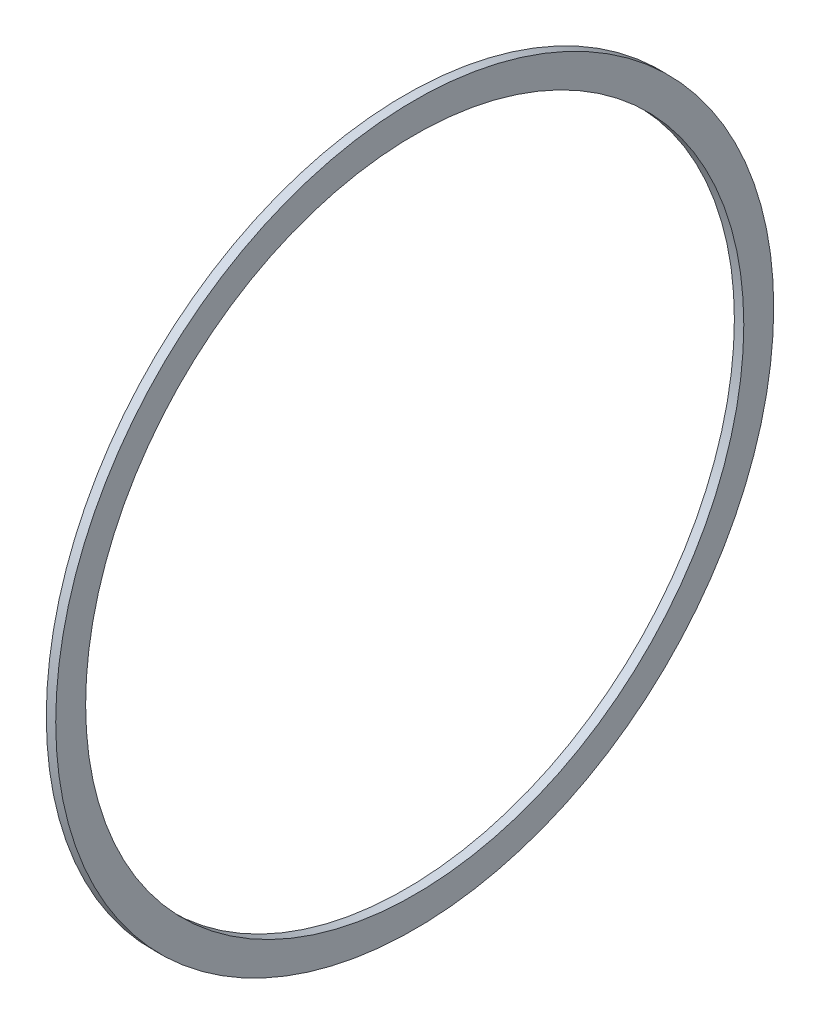
ISO-10303-21;
HEADER;
FILE_DESCRIPTION(('STEP AP214'),'2;1');
FILE_NAME('part.step','',(''),(''),'','','');
FILE_SCHEMA(('AUTOMOTIVE_DESIGN { 1 0 10303 214 1 1 1 1 }'));
ENDSEC;
DATA;
#1=APPLICATION_CONTEXT('core data for automotive mechanical design processes');
#2=APPLICATION_PROTOCOL_DEFINITION('international standard','automotive_design',2000,#1);
#3=PRODUCT_CONTEXT('',#1,'mechanical');
#4=PRODUCT('Part','Part','',(#3));
#5=PRODUCT_RELATED_PRODUCT_CATEGORY('part','',(#4));
#6=PRODUCT_DEFINITION_FORMATION('','',#4);
#7=PRODUCT_DEFINITION_CONTEXT('part definition',#1,'design');
#8=PRODUCT_DEFINITION('design','',#6,#7);
#9=PRODUCT_DEFINITION_SHAPE('','',#8);
#10=(LENGTH_UNIT() NAMED_UNIT(*) SI_UNIT(.MILLI.,.METRE.));
#11=(NAMED_UNIT(*) PLANE_ANGLE_UNIT() SI_UNIT($,.RADIAN.));
#12=(NAMED_UNIT(*) SI_UNIT($,.STERADIAN.) SOLID_ANGLE_UNIT());
#13=UNCERTAINTY_MEASURE_WITH_UNIT(LENGTH_MEASURE(1.E-05),#10,'distance_accuracy_value','');
#14=(GEOMETRIC_REPRESENTATION_CONTEXT(3) GLOBAL_UNCERTAINTY_ASSIGNED_CONTEXT((#13)) GLOBAL_UNIT_ASSIGNED_CONTEXT((#10,
#11,#12)) REPRESENTATION_CONTEXT('',''));
#15=CARTESIAN_POINT('',(0.,0.,0.));
#16=DIRECTION('',(0.,0.,1.));
#17=DIRECTION('',(1.,0.,0.));
#18=AXIS2_PLACEMENT_3D('',#15,#16,#17);
#19=CARTESIAN_POINT('',(1.,0.,0.));
#20=DIRECTION('',(1.,0.,0.));
#21=DIRECTION('',(0.,0.,-1.));
#22=AXIS2_PLACEMENT_3D('',#19,#20,#21);
#23=PLANE('',#22);
#24=CARTESIAN_POINT('',(1.,0.,0.));
#25=DIRECTION('',(1.,0.,0.));
#26=DIRECTION('',(0.,0.,-1.));
#27=AXIS2_PLACEMENT_3D('',#24,#25,#26);
#28=CIRCLE('',#27,76.2);
#29=CARTESIAN_POINT('',(1.,0.,-76.2));
#30=VERTEX_POINT('',#29);
#31=EDGE_CURVE('E10',#30,#30,#28,.T.);
#32=ORIENTED_EDGE('',*,*,#31,.T.);
#33=EDGE_LOOP('',(#32));
#34=FACE_BOUND('',#33,.T.);
#35=CARTESIAN_POINT('',(1.,0.,0.));
#36=DIRECTION('',(1.,0.,0.));
#37=DIRECTION('',(0.,0.,-1.));
#38=AXIS2_PLACEMENT_3D('',#35,#36,#37);
#39=CIRCLE('',#38,69.85);
#40=CARTESIAN_POINT('',(1.,0.,-69.85));
#41=VERTEX_POINT('',#40);
#42=EDGE_CURVE('E42',#41,#41,#39,.T.);
#43=ORIENTED_EDGE('',*,*,#42,.F.);
#44=EDGE_LOOP('',(#43));
#45=FACE_BOUND('',#44,.T.);
#46=ADVANCED_FACE('F31',(#34,#45),#23,.T.);
#47=CARTESIAN_POINT('',(-1.,0.,0.));
#48=DIRECTION('',(1.,0.,0.));
#49=DIRECTION('',(0.,0.,-1.));
#50=AXIS2_PLACEMENT_3D('',#47,#48,#49);
#51=PLANE('',#50);
#52=CARTESIAN_POINT('',(-1.,0.,0.));
#53=DIRECTION('',(1.,0.,0.));
#54=DIRECTION('',(0.,0.,-1.));
#55=AXIS2_PLACEMENT_3D('',#52,#53,#54);
#56=CIRCLE('',#55,76.2);
#57=CARTESIAN_POINT('',(-1.,0.,-76.2));
#58=VERTEX_POINT('',#57);
#59=EDGE_CURVE('E35',#58,#58,#56,.T.);
#60=ORIENTED_EDGE('',*,*,#59,.F.);
#61=EDGE_LOOP('',(#60));
#62=FACE_BOUND('',#61,.T.);
#63=CARTESIAN_POINT('',(-1.,0.,0.));
#64=DIRECTION('',(1.,0.,0.));
#65=DIRECTION('',(0.,0.,-1.));
#66=AXIS2_PLACEMENT_3D('',#63,#64,#65);
#67=CIRCLE('',#66,69.85);
#68=CARTESIAN_POINT('',(-1.,0.,-69.85));
#69=VERTEX_POINT('',#68);
#70=EDGE_CURVE('E44',#69,#69,#67,.T.);
#71=ORIENTED_EDGE('',*,*,#70,.T.);
#72=EDGE_LOOP('',(#71));
#73=FACE_BOUND('',#72,.T.);
#74=ADVANCED_FACE('F54',(#62,#73),#51,.F.);
#75=CARTESIAN_POINT('',(1.,0.,0.));
#76=DIRECTION('',(-1.,0.,0.));
#77=DIRECTION('',(0.,0.,1.));
#78=AXIS2_PLACEMENT_3D('',#75,#76,#77);
#79=CYLINDRICAL_SURFACE('',#78,76.2);
#80=ORIENTED_EDGE('',*,*,#31,.F.);
#81=EDGE_LOOP('',(#80));
#82=FACE_BOUND('',#81,.T.);
#83=ORIENTED_EDGE('',*,*,#59,.T.);
#84=EDGE_LOOP('',(#83));
#85=FACE_BOUND('',#84,.T.);
#86=ADVANCED_FACE('F33',(#82,#85),#79,.T.);
#87=CARTESIAN_POINT('',(1.,0.,0.));
#88=DIRECTION('',(-1.,0.,0.));
#89=DIRECTION('',(0.,0.,1.));
#90=AXIS2_PLACEMENT_3D('',#87,#88,#89);
#91=CYLINDRICAL_SURFACE('',#90,69.85);
#92=ORIENTED_EDGE('',*,*,#42,.T.);
#93=EDGE_LOOP('',(#92));
#94=FACE_BOUND('',#93,.T.);
#95=ORIENTED_EDGE('',*,*,#70,.F.);
#96=EDGE_LOOP('',(#95));
#97=FACE_BOUND('',#96,.T.);
#98=ADVANCED_FACE('F50',(#94,#97),#91,.F.);
#99=CLOSED_SHELL('',(#46,#74,#86,#98));
#100=MANIFOLD_SOLID_BREP('B2',#99);
#101=ADVANCED_BREP_SHAPE_REPRESENTATION('',(#18,#100),#14);
#102=SHAPE_DEFINITION_REPRESENTATION(#9,#101);
ENDSEC;
END-ISO-10303-21;
